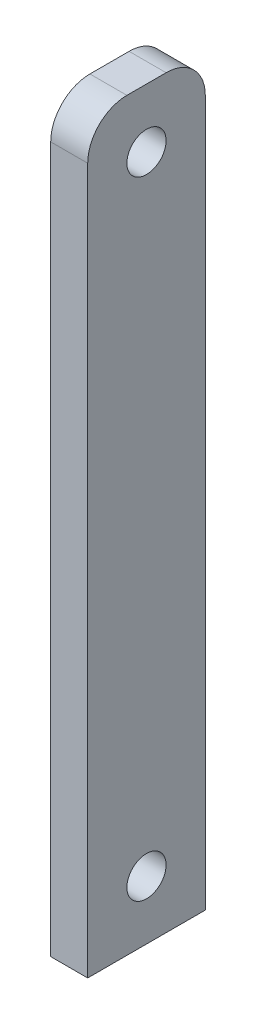
ISO-10303-21;
HEADER;
FILE_DESCRIPTION(('STEP AP214'),'2;1');
FILE_NAME('part.step','',(''),(''),'','','');
FILE_SCHEMA(('AUTOMOTIVE_DESIGN { 1 0 10303 214 1 1 1 1 }'));
ENDSEC;
DATA;
#1=APPLICATION_CONTEXT('core data for automotive mechanical design processes');
#2=APPLICATION_PROTOCOL_DEFINITION('international standard','automotive_design',2000,#1);
#3=PRODUCT_CONTEXT('',#1,'mechanical');
#4=PRODUCT('Part','Part','',(#3));
#5=PRODUCT_RELATED_PRODUCT_CATEGORY('part','',(#4));
#6=PRODUCT_DEFINITION_FORMATION('','',#4);
#7=PRODUCT_DEFINITION_CONTEXT('part definition',#1,'design');
#8=PRODUCT_DEFINITION('design','',#6,#7);
#9=PRODUCT_DEFINITION_SHAPE('','',#8);
#10=(LENGTH_UNIT() NAMED_UNIT(*) SI_UNIT(.MILLI.,.METRE.));
#11=(NAMED_UNIT(*) PLANE_ANGLE_UNIT() SI_UNIT($,.RADIAN.));
#12=(NAMED_UNIT(*) SI_UNIT($,.STERADIAN.) SOLID_ANGLE_UNIT());
#13=UNCERTAINTY_MEASURE_WITH_UNIT(LENGTH_MEASURE(1.E-05),#10,'distance_accuracy_value','');
#14=(GEOMETRIC_REPRESENTATION_CONTEXT(3) GLOBAL_UNCERTAINTY_ASSIGNED_CONTEXT((#13)) GLOBAL_UNIT_ASSIGNED_CONTEXT((#10,
#11,#12)) REPRESENTATION_CONTEXT('',''));
#15=CARTESIAN_POINT('',(0.,0.,0.));
#16=DIRECTION('',(0.,0.,1.));
#17=DIRECTION('',(1.,0.,0.));
#18=AXIS2_PLACEMENT_3D('',#15,#16,#17);
#19=CARTESIAN_POINT('',(1.4986,55.5625,-4.7625));
#20=DIRECTION('',(-1.,0.,0.));
#21=DIRECTION('',(0.,0.,1.));
#22=AXIS2_PLACEMENT_3D('',#19,#20,#21);
#23=PLANE('',#22);
#24=CARTESIAN_POINT('',(1.4986,0.,0.));
#25=DIRECTION('',(1.,0.,0.));
#26=DIRECTION('',(0.,0.,-1.));
#27=AXIS2_PLACEMENT_3D('',#24,#25,#26);
#28=CIRCLE('',#27,1.5875);
#29=CARTESIAN_POINT('',(1.4986,0.,-1.5875));
#30=VERTEX_POINT('',#29);
#31=EDGE_CURVE('E113',#30,#30,#28,.T.);
#32=ORIENTED_EDGE('',*,*,#31,.F.);
#33=EDGE_LOOP('',(#32));
#34=FACE_BOUND('',#33,.T.);
#35=DIRECTION('',(0.,1.,0.));
#36=VECTOR('',#35,1.);
#37=CARTESIAN_POINT('',(1.4986,-4.76250000000001,-4.7625));
#38=LINE('',#37,#36);
#39=CARTESIAN_POINT('',(1.4986,-4.76250000000001,-4.7625));
#40=VERTEX_POINT('',#39);
#41=CARTESIAN_POINT('',(1.4986,52.3875,-4.7625));
#42=VERTEX_POINT('',#41);
#43=EDGE_CURVE('E118',#40,#42,#38,.T.);
#44=ORIENTED_EDGE('',*,*,#43,.T.);
#45=CARTESIAN_POINT('',(1.4986,52.3875,-1.5875));
#46=DIRECTION('',(-1.,0.,0.));
#47=DIRECTION('',(0.,0.,1.));
#48=AXIS2_PLACEMENT_3D('',#45,#46,#47);
#49=CIRCLE('',#48,3.175);
#50=CARTESIAN_POINT('',(1.4986,55.5625,-1.5875));
#51=VERTEX_POINT('',#50);
#52=EDGE_CURVE('E39',#42,#51,#49,.F.);
#53=ORIENTED_EDGE('',*,*,#52,.T.);
#54=DIRECTION('',(0.,0.,1.));
#55=VECTOR('',#54,1.);
#56=CARTESIAN_POINT('',(1.4986,55.5625,4.7625));
#57=LINE('',#56,#55);
#58=CARTESIAN_POINT('',(1.4986,55.5625,1.5875));
#59=VERTEX_POINT('',#58);
#60=EDGE_CURVE('E92',#51,#59,#57,.T.);
#61=ORIENTED_EDGE('',*,*,#60,.T.);
#62=CARTESIAN_POINT('',(1.4986,52.3875,1.5875));
#63=DIRECTION('',(-1.,0.,0.));
#64=DIRECTION('',(0.,0.,1.));
#65=AXIS2_PLACEMENT_3D('',#62,#63,#64);
#66=CIRCLE('',#65,3.175);
#67=CARTESIAN_POINT('',(1.4986,52.3875,4.7625));
#68=VERTEX_POINT('',#67);
#69=EDGE_CURVE('E46',#59,#68,#66,.F.);
#70=ORIENTED_EDGE('',*,*,#69,.T.);
#71=DIRECTION('',(0.,-1.,0.));
#72=VECTOR('',#71,1.);
#73=CARTESIAN_POINT('',(1.4986,-4.76250000000001,4.7625));
#74=LINE('',#73,#72);
#75=CARTESIAN_POINT('',(1.4986,-4.76250000000001,4.7625));
#76=VERTEX_POINT('',#75);
#77=EDGE_CURVE('E84',#68,#76,#74,.T.);
#78=ORIENTED_EDGE('',*,*,#77,.T.);
#79=DIRECTION('',(0.,0.,-1.));
#80=VECTOR('',#79,1.);
#81=CARTESIAN_POINT('',(1.4986,-4.76250000000001,4.7625));
#82=LINE('',#81,#80);
#83=EDGE_CURVE('E88',#76,#40,#82,.T.);
#84=ORIENTED_EDGE('',*,*,#83,.T.);
#85=EDGE_LOOP('',(#44,#53,#61,#70,#78,#84));
#86=FACE_BOUND('',#85,.T.);
#87=CARTESIAN_POINT('',(1.4986,50.8,0.));
#88=DIRECTION('',(1.,0.,0.));
#89=DIRECTION('',(0.,0.,-1.));
#90=AXIS2_PLACEMENT_3D('',#87,#88,#89);
#91=CIRCLE('',#90,1.5875);
#92=CARTESIAN_POINT('',(1.4986,50.8,-1.5875));
#93=VERTEX_POINT('',#92);
#94=EDGE_CURVE('E148',#93,#93,#91,.T.);
#95=ORIENTED_EDGE('',*,*,#94,.F.);
#96=EDGE_LOOP('',(#95));
#97=FACE_BOUND('',#96,.T.);
#98=ADVANCED_FACE('F31',(#34,#86,#97),#23,.F.);
#99=CARTESIAN_POINT('',(-1.4986,55.5625,-4.7625));
#100=DIRECTION('',(-1.,0.,0.));
#101=DIRECTION('',(0.,0.,1.));
#102=AXIS2_PLACEMENT_3D('',#99,#100,#101);
#103=PLANE('',#102);
#104=CARTESIAN_POINT('',(-1.4986,0.,0.));
#105=DIRECTION('',(1.,0.,0.));
#106=DIRECTION('',(0.,0.,-1.));
#107=AXIS2_PLACEMENT_3D('',#104,#105,#106);
#108=CIRCLE('',#107,1.5875);
#109=CARTESIAN_POINT('',(-1.4986,0.,-1.5875));
#110=VERTEX_POINT('',#109);
#111=EDGE_CURVE('E145',#110,#110,#108,.T.);
#112=ORIENTED_EDGE('',*,*,#111,.T.);
#113=EDGE_LOOP('',(#112));
#114=FACE_BOUND('',#113,.T.);
#115=DIRECTION('',(0.,0.,1.));
#116=VECTOR('',#115,1.);
#117=CARTESIAN_POINT('',(-1.4986,55.5625,4.7625));
#118=LINE('',#117,#116);
#119=CARTESIAN_POINT('',(-1.4986,55.5625,-1.5875));
#120=VERTEX_POINT('',#119);
#121=CARTESIAN_POINT('',(-1.4986,55.5625,1.5875));
#122=VERTEX_POINT('',#121);
#123=EDGE_CURVE('E112',#120,#122,#118,.T.);
#124=ORIENTED_EDGE('',*,*,#123,.F.);
#125=CARTESIAN_POINT('',(-1.4986,52.3875,-1.5875));
#126=DIRECTION('',(-1.,0.,0.));
#127=DIRECTION('',(0.,0.,1.));
#128=AXIS2_PLACEMENT_3D('',#125,#126,#127);
#129=CIRCLE('',#128,3.175);
#130=CARTESIAN_POINT('',(-1.4986,52.3875,-4.7625));
#131=VERTEX_POINT('',#130);
#132=EDGE_CURVE('E126',#120,#131,#129,.T.);
#133=ORIENTED_EDGE('',*,*,#132,.T.);
#134=DIRECTION('',(0.,1.,0.));
#135=VECTOR('',#134,1.);
#136=CARTESIAN_POINT('',(-1.4986,-4.76250000000001,-4.7625));
#137=LINE('',#136,#135);
#138=CARTESIAN_POINT('',(-1.4986,-4.76250000000001,-4.7625));
#139=VERTEX_POINT('',#138);
#140=EDGE_CURVE('E110',#139,#131,#137,.T.);
#141=ORIENTED_EDGE('',*,*,#140,.F.);
#142=DIRECTION('',(0.,0.,-1.));
#143=VECTOR('',#142,1.);
#144=CARTESIAN_POINT('',(-1.4986,-4.76250000000001,4.7625));
#145=LINE('',#144,#143);
#146=CARTESIAN_POINT('',(-1.4986,-4.76250000000001,4.7625));
#147=VERTEX_POINT('',#146);
#148=EDGE_CURVE('E117',#147,#139,#145,.T.);
#149=ORIENTED_EDGE('',*,*,#148,.F.);
#150=DIRECTION('',(0.,-1.,0.));
#151=VECTOR('',#150,1.);
#152=CARTESIAN_POINT('',(-1.4986,-4.76250000000001,4.7625));
#153=LINE('',#152,#151);
#154=CARTESIAN_POINT('',(-1.4986,52.3875,4.7625));
#155=VERTEX_POINT('',#154);
#156=EDGE_CURVE('E98',#155,#147,#153,.T.);
#157=ORIENTED_EDGE('',*,*,#156,.F.);
#158=CARTESIAN_POINT('',(-1.4986,52.3875,1.5875));
#159=DIRECTION('',(-1.,0.,0.));
#160=DIRECTION('',(0.,0.,1.));
#161=AXIS2_PLACEMENT_3D('',#158,#159,#160);
#162=CIRCLE('',#161,3.175);
#163=EDGE_CURVE('E124',#155,#122,#162,.T.);
#164=ORIENTED_EDGE('',*,*,#163,.T.);
#165=EDGE_LOOP('',(#124,#133,#141,#149,#157,#164));
#166=FACE_BOUND('',#165,.T.);
#167=CARTESIAN_POINT('',(-1.4986,50.8,0.));
#168=DIRECTION('',(1.,0.,0.));
#169=DIRECTION('',(0.,0.,-1.));
#170=AXIS2_PLACEMENT_3D('',#167,#168,#169);
#171=CIRCLE('',#170,1.5875);
#172=CARTESIAN_POINT('',(-1.4986,50.8,-1.5875));
#173=VERTEX_POINT('',#172);
#174=EDGE_CURVE('E151',#173,#173,#171,.T.);
#175=ORIENTED_EDGE('',*,*,#174,.T.);
#176=EDGE_LOOP('',(#175));
#177=FACE_BOUND('',#176,.T.);
#178=ADVANCED_FACE('F140',(#114,#166,#177),#103,.T.);
#179=CARTESIAN_POINT('',(1.4986,-4.76250000000001,-4.7625));
#180=DIRECTION('',(0.,0.,1.));
#181=DIRECTION('',(1.,0.,0.));
#182=AXIS2_PLACEMENT_3D('',#179,#180,#181);
#183=PLANE('',#182);
#184=ORIENTED_EDGE('',*,*,#140,.T.);
#185=DIRECTION('',(-1.,0.,0.));
#186=VECTOR('',#185,1.);
#187=CARTESIAN_POINT('',(1.4986,52.3875,-4.7625));
#188=LINE('',#187,#186);
#189=EDGE_CURVE('E54',#131,#42,#188,.F.);
#190=ORIENTED_EDGE('',*,*,#189,.T.);
#191=ORIENTED_EDGE('',*,*,#43,.F.);
#192=DIRECTION('',(-1.,0.,0.));
#193=VECTOR('',#192,1.);
#194=CARTESIAN_POINT('',(1.4986,-4.76250000000001,-4.7625));
#195=LINE('',#194,#193);
#196=EDGE_CURVE('E102',#40,#139,#195,.T.);
#197=ORIENTED_EDGE('',*,*,#196,.T.);
#198=EDGE_LOOP('',(#184,#190,#191,#197));
#199=FACE_BOUND('',#198,.T.);
#200=ADVANCED_FACE('F142',(#199),#183,.F.);
#201=CARTESIAN_POINT('',(1.4986,55.5625,4.7625));
#202=DIRECTION('',(0.,-1.,0.));
#203=DIRECTION('',(0.,0.,-1.));
#204=AXIS2_PLACEMENT_3D('',#201,#202,#203);
#205=PLANE('',#204);
#206=ORIENTED_EDGE('',*,*,#60,.F.);
#207=DIRECTION('',(-1.,0.,0.));
#208=VECTOR('',#207,1.);
#209=CARTESIAN_POINT('',(1.4986,55.5625,-1.5875));
#210=LINE('',#209,#208);
#211=EDGE_CURVE('E121',#51,#120,#210,.T.);
#212=ORIENTED_EDGE('',*,*,#211,.T.);
#213=ORIENTED_EDGE('',*,*,#123,.T.);
#214=DIRECTION('',(-1.,0.,0.));
#215=VECTOR('',#214,1.);
#216=CARTESIAN_POINT('',(1.4986,55.5625,1.5875));
#217=LINE('',#216,#215);
#218=EDGE_CURVE('E101',#122,#59,#217,.F.);
#219=ORIENTED_EDGE('',*,*,#218,.T.);
#220=EDGE_LOOP('',(#206,#212,#213,#219));
#221=FACE_BOUND('',#220,.T.);
#222=ADVANCED_FACE('F134',(#221),#205,.F.);
#223=CARTESIAN_POINT('',(1.4986,-4.76250000000001,4.7625));
#224=DIRECTION('',(0.,0.,-1.));
#225=DIRECTION('',(0.,1.,0.));
#226=AXIS2_PLACEMENT_3D('',#223,#224,#225);
#227=PLANE('',#226);
#228=ORIENTED_EDGE('',*,*,#77,.F.);
#229=DIRECTION('',(-1.,0.,0.));
#230=VECTOR('',#229,1.);
#231=CARTESIAN_POINT('',(1.4986,52.3875,4.7625));
#232=LINE('',#231,#230);
#233=EDGE_CURVE('E11',#68,#155,#232,.T.);
#234=ORIENTED_EDGE('',*,*,#233,.T.);
#235=ORIENTED_EDGE('',*,*,#156,.T.);
#236=DIRECTION('',(-1.,0.,0.));
#237=VECTOR('',#236,1.);
#238=CARTESIAN_POINT('',(1.4986,-4.76250000000001,4.7625));
#239=LINE('',#238,#237);
#240=EDGE_CURVE('E95',#76,#147,#239,.T.);
#241=ORIENTED_EDGE('',*,*,#240,.F.);
#242=EDGE_LOOP('',(#228,#234,#235,#241));
#243=FACE_BOUND('',#242,.T.);
#244=ADVANCED_FACE('F96',(#243),#227,.F.);
#245=CARTESIAN_POINT('',(1.4986,-4.76250000000001,4.7625));
#246=DIRECTION('',(0.,1.,0.));
#247=DIRECTION('',(0.,0.,1.));
#248=AXIS2_PLACEMENT_3D('',#245,#246,#247);
#249=PLANE('',#248);
#250=ORIENTED_EDGE('',*,*,#148,.T.);
#251=ORIENTED_EDGE('',*,*,#196,.F.);
#252=ORIENTED_EDGE('',*,*,#83,.F.);
#253=ORIENTED_EDGE('',*,*,#240,.T.);
#254=EDGE_LOOP('',(#250,#251,#252,#253));
#255=FACE_BOUND('',#254,.T.);
#256=ADVANCED_FACE('F104',(#255),#249,.F.);
#257=CARTESIAN_POINT('',(1.4986,0.,0.));
#258=DIRECTION('',(-1.,0.,0.));
#259=DIRECTION('',(0.,0.,1.));
#260=AXIS2_PLACEMENT_3D('',#257,#258,#259);
#261=CYLINDRICAL_SURFACE('',#260,1.5875);
#262=ORIENTED_EDGE('',*,*,#31,.T.);
#263=EDGE_LOOP('',(#262));
#264=FACE_BOUND('',#263,.T.);
#265=ORIENTED_EDGE('',*,*,#111,.F.);
#266=EDGE_LOOP('',(#265));
#267=FACE_BOUND('',#266,.T.);
#268=ADVANCED_FACE('F169',(#264,#267),#261,.F.);
#269=CARTESIAN_POINT('',(1.4986,50.8,0.));
#270=DIRECTION('',(-1.,0.,0.));
#271=DIRECTION('',(0.,0.,1.));
#272=AXIS2_PLACEMENT_3D('',#269,#270,#271);
#273=CYLINDRICAL_SURFACE('',#272,1.5875);
#274=ORIENTED_EDGE('',*,*,#94,.T.);
#275=EDGE_LOOP('',(#274));
#276=FACE_BOUND('',#275,.T.);
#277=ORIENTED_EDGE('',*,*,#174,.F.);
#278=EDGE_LOOP('',(#277));
#279=FACE_BOUND('',#278,.T.);
#280=ADVANCED_FACE('F157',(#276,#279),#273,.F.);
#281=CARTESIAN_POINT('',(1.4986,52.3875,-1.5875));
#282=DIRECTION('',(-1.,0.,0.));
#283=DIRECTION('',(0.,0.,1.));
#284=AXIS2_PLACEMENT_3D('',#281,#282,#283);
#285=CYLINDRICAL_SURFACE('',#284,3.175);
#286=ORIENTED_EDGE('',*,*,#52,.F.);
#287=ORIENTED_EDGE('',*,*,#189,.F.);
#288=ORIENTED_EDGE('',*,*,#132,.F.);
#289=ORIENTED_EDGE('',*,*,#211,.F.);
#290=EDGE_LOOP('',(#286,#287,#288,#289));
#291=FACE_BOUND('',#290,.T.);
#292=ADVANCED_FACE('F137',(#291),#285,.T.);
#293=CARTESIAN_POINT('',(1.4986,52.3875,1.5875));
#294=DIRECTION('',(-1.,0.,0.));
#295=DIRECTION('',(0.,0.,1.));
#296=AXIS2_PLACEMENT_3D('',#293,#294,#295);
#297=CYLINDRICAL_SURFACE('',#296,3.175);
#298=ORIENTED_EDGE('',*,*,#69,.F.);
#299=ORIENTED_EDGE('',*,*,#218,.F.);
#300=ORIENTED_EDGE('',*,*,#163,.F.);
#301=ORIENTED_EDGE('',*,*,#233,.F.);
#302=EDGE_LOOP('',(#298,#299,#300,#301));
#303=FACE_BOUND('',#302,.T.);
#304=ADVANCED_FACE('F33',(#303),#297,.T.);
#305=CLOSED_SHELL('',(#98,#178,#200,#222,#244,#256,#268,#280,#292,#304));
#306=MANIFOLD_SOLID_BREP('B2',#305);
#307=ADVANCED_BREP_SHAPE_REPRESENTATION('',(#18,#306),#14);
#308=SHAPE_DEFINITION_REPRESENTATION(#9,#307);
ENDSEC;
END-ISO-10303-21;
